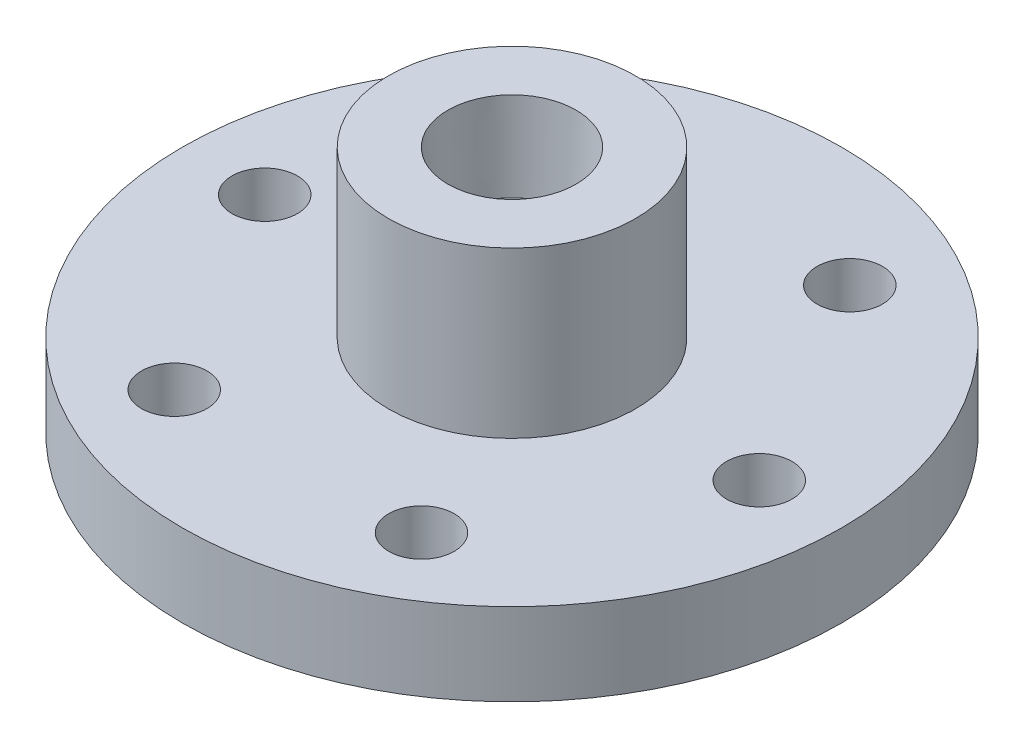
ISO-10303-21;
HEADER;
FILE_DESCRIPTION(('STEP AP214'),'2;1');
FILE_NAME('part.step','',(''),(''),'','','');
FILE_SCHEMA(('AUTOMOTIVE_DESIGN { 1 0 10303 214 1 1 1 1 }'));
ENDSEC;
DATA;
#1=APPLICATION_CONTEXT('core data for automotive mechanical design processes');
#2=APPLICATION_PROTOCOL_DEFINITION('international standard','automotive_design',2000,#1);
#3=PRODUCT_CONTEXT('',#1,'mechanical');
#4=PRODUCT('Part','Part','',(#3));
#5=PRODUCT_RELATED_PRODUCT_CATEGORY('part','',(#4));
#6=PRODUCT_DEFINITION_FORMATION('','',#4);
#7=PRODUCT_DEFINITION_CONTEXT('part definition',#1,'design');
#8=PRODUCT_DEFINITION('design','',#6,#7);
#9=PRODUCT_DEFINITION_SHAPE('','',#8);
#10=(LENGTH_UNIT() NAMED_UNIT(*) SI_UNIT(.MILLI.,.METRE.));
#11=(NAMED_UNIT(*) PLANE_ANGLE_UNIT() SI_UNIT($,.RADIAN.));
#12=(NAMED_UNIT(*) SI_UNIT($,.STERADIAN.) SOLID_ANGLE_UNIT());
#13=UNCERTAINTY_MEASURE_WITH_UNIT(LENGTH_MEASURE(1.E-05),#10,'distance_accuracy_value','');
#14=(GEOMETRIC_REPRESENTATION_CONTEXT(3) GLOBAL_UNCERTAINTY_ASSIGNED_CONTEXT((#13)) GLOBAL_UNIT_ASSIGNED_CONTEXT((#10,
#11,#12)) REPRESENTATION_CONTEXT('',''));
#15=CARTESIAN_POINT('',(0.,0.,0.));
#16=DIRECTION('',(0.,0.,1.));
#17=DIRECTION('',(1.,0.,0.));
#18=AXIS2_PLACEMENT_3D('',#15,#16,#17);
#19=CARTESIAN_POINT('',(-12.827,0.,0.));
#20=DIRECTION('',(0.,-1.,0.));
#21=DIRECTION('',(0.,0.,-1.));
#22=AXIS2_PLACEMENT_3D('',#19,#20,#21);
#23=PLANE('',#22);
#24=CARTESIAN_POINT('',(19.0500000000004,0.,-32.9955678841869));
#25=DIRECTION('',(0.,1.,0.));
#26=DIRECTION('',(0.,0.,1.));
#27=AXIS2_PLACEMENT_3D('',#24,#25,#26);
#28=CIRCLE('',#27,5.04189999999999);
#29=CARTESIAN_POINT('',(19.0500000000004,0.,-27.9536678841869));
#30=VERTEX_POINT('',#29);
#31=EDGE_CURVE('E141',#30,#30,#28,.T.);
#32=ORIENTED_EDGE('',*,*,#31,.T.);
#33=EDGE_LOOP('',(#32));
#34=FACE_BOUND('',#33,.T.);
#35=CARTESIAN_POINT('',(-19.0499999999997,0.,-32.9955678841873));
#36=DIRECTION('',(0.,1.,0.));
#37=DIRECTION('',(0.,0.,1.));
#38=AXIS2_PLACEMENT_3D('',#35,#36,#37);
#39=CIRCLE('',#38,5.04189999999999);
#40=CARTESIAN_POINT('',(-19.0499999999997,0.,-27.9536678841873));
#41=VERTEX_POINT('',#40);
#42=EDGE_CURVE('E133',#41,#41,#39,.T.);
#43=ORIENTED_EDGE('',*,*,#42,.T.);
#44=EDGE_LOOP('',(#43));
#45=FACE_BOUND('',#44,.T.);
#46=CARTESIAN_POINT('',(-19.0500000000002,0.,32.995567884187));
#47=DIRECTION('',(0.,1.,0.));
#48=DIRECTION('',(0.,0.,1.));
#49=AXIS2_PLACEMENT_3D('',#46,#47,#48);
#50=CIRCLE('',#49,5.04189999999999);
#51=CARTESIAN_POINT('',(-19.0500000000002,0.,38.037467884187));
#52=VERTEX_POINT('',#51);
#53=EDGE_CURVE('E117',#52,#52,#50,.T.);
#54=ORIENTED_EDGE('',*,*,#53,.T.);
#55=EDGE_LOOP('',(#54));
#56=FACE_BOUND('',#55,.T.);
#57=CARTESIAN_POINT('',(19.0499999999999,0.,32.9955678841872));
#58=DIRECTION('',(0.,1.,0.));
#59=DIRECTION('',(0.,0.,1.));
#60=AXIS2_PLACEMENT_3D('',#57,#58,#59);
#61=CIRCLE('',#60,5.04189999999999);
#62=CARTESIAN_POINT('',(19.0499999999999,0.,38.0374678841872));
#63=VERTEX_POINT('',#62);
#64=EDGE_CURVE('E109',#63,#63,#61,.T.);
#65=ORIENTED_EDGE('',*,*,#64,.T.);
#66=EDGE_LOOP('',(#65));
#67=FACE_BOUND('',#66,.T.);
#68=CARTESIAN_POINT('',(38.1,0.,0.));
#69=DIRECTION('',(0.,1.,0.));
#70=DIRECTION('',(0.,0.,1.));
#71=AXIS2_PLACEMENT_3D('',#68,#69,#70);
#72=CIRCLE('',#71,5.04189999999999);
#73=CARTESIAN_POINT('',(38.1,0.,5.04189999999999));
#74=VERTEX_POINT('',#73);
#75=EDGE_CURVE('E101',#74,#74,#72,.T.);
#76=ORIENTED_EDGE('',*,*,#75,.T.);
#77=EDGE_LOOP('',(#76));
#78=FACE_BOUND('',#77,.T.);
#79=CARTESIAN_POINT('',(0.,0.,0.));
#80=DIRECTION('',(0.,1.,0.));
#81=DIRECTION('',(0.,0.,1.));
#82=AXIS2_PLACEMENT_3D('',#79,#80,#81);
#83=CIRCLE('',#82,12.827);
#84=CARTESIAN_POINT('',(0.,0.,12.827));
#85=VERTEX_POINT('',#84);
#86=EDGE_CURVE('E61',#85,#85,#83,.T.);
#87=ORIENTED_EDGE('',*,*,#86,.T.);
#88=EDGE_LOOP('',(#87));
#89=FACE_BOUND('',#88,.T.);
#90=CARTESIAN_POINT('',(0.,0.,0.));
#91=DIRECTION('',(0.,1.,0.));
#92=DIRECTION('',(0.,0.,1.));
#93=AXIS2_PLACEMENT_3D('',#90,#91,#92);
#94=CIRCLE('',#93,50.8);
#95=CARTESIAN_POINT('',(0.,0.,50.8));
#96=VERTEX_POINT('',#95);
#97=EDGE_CURVE('E65',#96,#96,#94,.T.);
#98=ORIENTED_EDGE('',*,*,#97,.F.);
#99=EDGE_LOOP('',(#98));
#100=FACE_BOUND('',#99,.T.);
#101=CARTESIAN_POINT('',(-38.1,0.,0.));
#102=DIRECTION('',(0.,1.,0.));
#103=DIRECTION('',(0.,0.,1.));
#104=AXIS2_PLACEMENT_3D('',#101,#102,#103);
#105=CIRCLE('',#104,5.04189999999999);
#106=CARTESIAN_POINT('',(-38.1,0.,5.04189999999999));
#107=VERTEX_POINT('',#106);
#108=EDGE_CURVE('E125',#107,#107,#105,.T.);
#109=ORIENTED_EDGE('',*,*,#108,.T.);
#110=EDGE_LOOP('',(#109));
#111=FACE_BOUND('',#110,.T.);
#112=ADVANCED_FACE('F41',(#34,#45,#56,#67,#78,#89,#100,#111),#23,.T.);
#113=CARTESIAN_POINT('',(0.,0.,0.));
#114=DIRECTION('',(0.,-1.,0.));
#115=DIRECTION('',(0.,0.,-1.));
#116=AXIS2_PLACEMENT_3D('',#113,#114,#115);
#117=PLANE('',#116);
#118=CARTESIAN_POINT('',(0.,0.,0.));
#119=DIRECTION('',(0.,1.,0.));
#120=DIRECTION('',(0.,0.,1.));
#121=AXIS2_PLACEMENT_3D('',#118,#119,#120);
#122=CIRCLE('',#121,4.76249999999999);
#123=CARTESIAN_POINT('',(0.,0.,4.76249999999999));
#124=VERTEX_POINT('',#123);
#125=EDGE_CURVE('E81',#124,#124,#122,.T.);
#126=ORIENTED_EDGE('',*,*,#125,.T.);
#127=EDGE_LOOP('',(#126));
#128=FACE_BOUND('',#127,.T.);
#129=CARTESIAN_POINT('',(0.,0.,0.));
#130=DIRECTION('',(0.,1.,0.));
#131=DIRECTION('',(0.,0.,1.));
#132=AXIS2_PLACEMENT_3D('',#129,#130,#131);
#133=CIRCLE('',#132,9.525);
#134=CARTESIAN_POINT('',(0.,0.,9.525));
#135=VERTEX_POINT('',#134);
#136=EDGE_CURVE('E10',#135,#135,#133,.T.);
#137=ORIENTED_EDGE('',*,*,#136,.F.);
#138=EDGE_LOOP('',(#137));
#139=FACE_BOUND('',#138,.T.);
#140=ADVANCED_FACE('F43',(#128,#139),#117,.T.);
#141=CARTESIAN_POINT('',(0.,38.1,0.));
#142=DIRECTION('',(0.,1.,0.));
#143=DIRECTION('',(0.,0.,1.));
#144=AXIS2_PLACEMENT_3D('',#141,#142,#143);
#145=CYLINDRICAL_SURFACE('',#144,9.525);
#146=ORIENTED_EDGE('',*,*,#136,.T.);
#147=EDGE_LOOP('',(#146));
#148=FACE_BOUND('',#147,.T.);
#149=CARTESIAN_POINT('',(0.,2.54,0.));
#150=DIRECTION('',(0.,1.,0.));
#151=DIRECTION('',(0.,0.,1.));
#152=AXIS2_PLACEMENT_3D('',#149,#150,#151);
#153=CIRCLE('',#152,9.525);
#154=CARTESIAN_POINT('',(0.,2.54,9.525));
#155=VERTEX_POINT('',#154);
#156=EDGE_CURVE('E50',#155,#155,#153,.T.);
#157=ORIENTED_EDGE('',*,*,#156,.F.);
#158=EDGE_LOOP('',(#157));
#159=FACE_BOUND('',#158,.T.);
#160=ADVANCED_FACE('F195',(#148,#159),#145,.T.);
#161=CARTESIAN_POINT('',(-9.525,2.54,0.));
#162=DIRECTION('',(0.,-1.,0.));
#163=DIRECTION('',(0.,0.,-1.));
#164=AXIS2_PLACEMENT_3D('',#161,#162,#163);
#165=PLANE('',#164);
#166=ORIENTED_EDGE('',*,*,#156,.T.);
#167=EDGE_LOOP('',(#166));
#168=FACE_BOUND('',#167,.T.);
#169=CARTESIAN_POINT('',(0.,2.54,0.));
#170=DIRECTION('',(0.,1.,0.));
#171=DIRECTION('',(0.,0.,1.));
#172=AXIS2_PLACEMENT_3D('',#169,#170,#171);
#173=CIRCLE('',#172,12.827);
#174=CARTESIAN_POINT('',(0.,2.54,12.827));
#175=VERTEX_POINT('',#174);
#176=EDGE_CURVE('E55',#175,#175,#173,.T.);
#177=ORIENTED_EDGE('',*,*,#176,.F.);
#178=EDGE_LOOP('',(#177));
#179=FACE_BOUND('',#178,.T.);
#180=ADVANCED_FACE('F203',(#168,#179),#165,.T.);
#181=CARTESIAN_POINT('',(0.,38.1,0.));
#182=DIRECTION('',(0.,1.,0.));
#183=DIRECTION('',(0.,0.,1.));
#184=AXIS2_PLACEMENT_3D('',#181,#182,#183);
#185=CYLINDRICAL_SURFACE('',#184,12.827);
#186=ORIENTED_EDGE('',*,*,#176,.T.);
#187=EDGE_LOOP('',(#186));
#188=FACE_BOUND('',#187,.T.);
#189=ORIENTED_EDGE('',*,*,#86,.F.);
#190=EDGE_LOOP('',(#189));
#191=FACE_BOUND('',#190,.T.);
#192=ADVANCED_FACE('F200',(#188,#191),#185,.F.);
#193=CARTESIAN_POINT('',(0.,38.1,0.));
#194=DIRECTION('',(0.,1.,0.));
#195=DIRECTION('',(0.,0.,1.));
#196=AXIS2_PLACEMENT_3D('',#193,#194,#195);
#197=CYLINDRICAL_SURFACE('',#196,50.8);
#198=ORIENTED_EDGE('',*,*,#97,.T.);
#199=EDGE_LOOP('',(#198));
#200=FACE_BOUND('',#199,.T.);
#201=CARTESIAN_POINT('',(0.,12.7,0.));
#202=DIRECTION('',(0.,1.,0.));
#203=DIRECTION('',(0.,0.,1.));
#204=AXIS2_PLACEMENT_3D('',#201,#202,#203);
#205=CIRCLE('',#204,50.8);
#206=CARTESIAN_POINT('',(0.,12.7,50.8));
#207=VERTEX_POINT('',#206);
#208=EDGE_CURVE('E69',#207,#207,#205,.T.);
#209=ORIENTED_EDGE('',*,*,#208,.F.);
#210=EDGE_LOOP('',(#209));
#211=FACE_BOUND('',#210,.T.);
#212=ADVANCED_FACE('F156',(#200,#211),#197,.T.);
#213=CARTESIAN_POINT('',(-50.8,12.7,0.));
#214=DIRECTION('',(0.,1.,0.));
#215=DIRECTION('',(0.,0.,1.));
#216=AXIS2_PLACEMENT_3D('',#213,#214,#215);
#217=PLANE('',#216);
#218=CARTESIAN_POINT('',(19.0500000000004,12.7,-32.9955678841869));
#219=DIRECTION('',(0.,1.,0.));
#220=DIRECTION('',(0.,0.,1.));
#221=AXIS2_PLACEMENT_3D('',#218,#219,#220);
#222=CIRCLE('',#221,5.0419);
#223=CARTESIAN_POINT('',(19.0500000000004,12.7,-27.9536678841869));
#224=VERTEX_POINT('',#223);
#225=EDGE_CURVE('E145',#224,#224,#222,.T.);
#226=ORIENTED_EDGE('',*,*,#225,.F.);
#227=EDGE_LOOP('',(#226));
#228=FACE_BOUND('',#227,.T.);
#229=CARTESIAN_POINT('',(-19.0499999999997,12.7,-32.9955678841873));
#230=DIRECTION('',(0.,1.,0.));
#231=DIRECTION('',(0.,0.,1.));
#232=AXIS2_PLACEMENT_3D('',#229,#230,#231);
#233=CIRCLE('',#232,5.0419);
#234=CARTESIAN_POINT('',(-19.0499999999997,12.7,-27.9536678841873));
#235=VERTEX_POINT('',#234);
#236=EDGE_CURVE('E137',#235,#235,#233,.T.);
#237=ORIENTED_EDGE('',*,*,#236,.F.);
#238=EDGE_LOOP('',(#237));
#239=FACE_BOUND('',#238,.T.);
#240=CARTESIAN_POINT('',(-38.1,12.7,0.));
#241=DIRECTION('',(0.,1.,0.));
#242=DIRECTION('',(0.,0.,1.));
#243=AXIS2_PLACEMENT_3D('',#240,#241,#242);
#244=CIRCLE('',#243,5.04189999999999);
#245=CARTESIAN_POINT('',(-38.1,12.7,5.04189999999999));
#246=VERTEX_POINT('',#245);
#247=EDGE_CURVE('E129',#246,#246,#244,.T.);
#248=ORIENTED_EDGE('',*,*,#247,.F.);
#249=EDGE_LOOP('',(#248));
#250=FACE_BOUND('',#249,.T.);
#251=CARTESIAN_POINT('',(-19.0500000000002,12.7,32.995567884187));
#252=DIRECTION('',(0.,1.,0.));
#253=DIRECTION('',(0.,0.,1.));
#254=AXIS2_PLACEMENT_3D('',#251,#252,#253);
#255=CIRCLE('',#254,5.0419);
#256=CARTESIAN_POINT('',(-19.0500000000002,12.7,38.037467884187));
#257=VERTEX_POINT('',#256);
#258=EDGE_CURVE('E121',#257,#257,#255,.T.);
#259=ORIENTED_EDGE('',*,*,#258,.F.);
#260=EDGE_LOOP('',(#259));
#261=FACE_BOUND('',#260,.T.);
#262=CARTESIAN_POINT('',(19.0499999999999,12.7,32.9955678841872));
#263=DIRECTION('',(0.,1.,0.));
#264=DIRECTION('',(0.,0.,1.));
#265=AXIS2_PLACEMENT_3D('',#262,#263,#264);
#266=CIRCLE('',#265,5.0419);
#267=CARTESIAN_POINT('',(19.0499999999999,12.7,38.0374678841872));
#268=VERTEX_POINT('',#267);
#269=EDGE_CURVE('E113',#268,#268,#266,.T.);
#270=ORIENTED_EDGE('',*,*,#269,.F.);
#271=EDGE_LOOP('',(#270));
#272=FACE_BOUND('',#271,.T.);
#273=CARTESIAN_POINT('',(38.1,12.7,0.));
#274=DIRECTION('',(0.,1.,0.));
#275=DIRECTION('',(0.,0.,1.));
#276=AXIS2_PLACEMENT_3D('',#273,#274,#275);
#277=CIRCLE('',#276,5.04189999999999);
#278=CARTESIAN_POINT('',(38.1,12.7,5.04189999999999));
#279=VERTEX_POINT('',#278);
#280=EDGE_CURVE('E105',#279,#279,#277,.T.);
#281=ORIENTED_EDGE('',*,*,#280,.F.);
#282=EDGE_LOOP('',(#281));
#283=FACE_BOUND('',#282,.T.);
#284=ORIENTED_EDGE('',*,*,#208,.T.);
#285=EDGE_LOOP('',(#284));
#286=FACE_BOUND('',#285,.T.);
#287=CARTESIAN_POINT('',(0.,12.7,0.));
#288=DIRECTION('',(0.,1.,0.));
#289=DIRECTION('',(0.,0.,1.));
#290=AXIS2_PLACEMENT_3D('',#287,#288,#289);
#291=CIRCLE('',#290,19.05);
#292=CARTESIAN_POINT('',(0.,12.7,19.05));
#293=VERTEX_POINT('',#292);
#294=EDGE_CURVE('E73',#293,#293,#291,.T.);
#295=ORIENTED_EDGE('',*,*,#294,.F.);
#296=EDGE_LOOP('',(#295));
#297=FACE_BOUND('',#296,.T.);
#298=ADVANCED_FACE('F152',(#228,#239,#250,#261,#272,#283,#286,#297),#217,.T.);
#299=CARTESIAN_POINT('',(0.,38.1,0.));
#300=DIRECTION('',(0.,1.,0.));
#301=DIRECTION('',(0.,0.,1.));
#302=AXIS2_PLACEMENT_3D('',#299,#300,#301);
#303=CYLINDRICAL_SURFACE('',#302,19.05);
#304=ORIENTED_EDGE('',*,*,#294,.T.);
#305=EDGE_LOOP('',(#304));
#306=FACE_BOUND('',#305,.T.);
#307=CARTESIAN_POINT('',(0.,38.1,0.));
#308=DIRECTION('',(0.,1.,0.));
#309=DIRECTION('',(0.,0.,1.));
#310=AXIS2_PLACEMENT_3D('',#307,#308,#309);
#311=CIRCLE('',#310,19.05);
#312=CARTESIAN_POINT('',(0.,38.1,19.05));
#313=VERTEX_POINT('',#312);
#314=EDGE_CURVE('E77',#313,#313,#311,.T.);
#315=ORIENTED_EDGE('',*,*,#314,.F.);
#316=EDGE_LOOP('',(#315));
#317=FACE_BOUND('',#316,.T.);
#318=ADVANCED_FACE('F155',(#306,#317),#303,.T.);
#319=CARTESIAN_POINT('',(-19.05,38.1,0.));
#320=DIRECTION('',(0.,1.,0.));
#321=DIRECTION('',(0.,0.,1.));
#322=AXIS2_PLACEMENT_3D('',#319,#320,#321);
#323=PLANE('',#322);
#324=CARTESIAN_POINT('',(0.,38.1,0.));
#325=DIRECTION('',(0.,1.,0.));
#326=DIRECTION('',(0.,0.,1.));
#327=AXIS2_PLACEMENT_3D('',#324,#325,#326);
#328=CIRCLE('',#327,9.8827971);
#329=CARTESIAN_POINT('',(0.,38.1,9.8827971));
#330=VERTEX_POINT('',#329);
#331=EDGE_CURVE('E97',#330,#330,#328,.T.);
#332=ORIENTED_EDGE('',*,*,#331,.F.);
#333=EDGE_LOOP('',(#332));
#334=FACE_BOUND('',#333,.T.);
#335=ORIENTED_EDGE('',*,*,#314,.T.);
#336=EDGE_LOOP('',(#335));
#337=FACE_BOUND('',#336,.T.);
#338=ADVANCED_FACE('F174',(#334,#337),#323,.T.);
#339=CARTESIAN_POINT('',(0.,38.1,0.));
#340=DIRECTION('',(0.,1.,0.));
#341=DIRECTION('',(0.,0.,1.));
#342=AXIS2_PLACEMENT_3D('',#339,#340,#341);
#343=CYLINDRICAL_SURFACE('',#342,4.76249999999999);
#344=CARTESIAN_POINT('',(0.,12.9910550053788,0.));
#345=DIRECTION('',(0.,1.,0.));
#346=DIRECTION('',(0.,0.,1.));
#347=AXIS2_PLACEMENT_3D('',#344,#345,#346);
#348=CIRCLE('',#347,4.76249999999999);
#349=CARTESIAN_POINT('',(0.,12.9910550053788,4.76249999999999));
#350=VERTEX_POINT('',#349);
#351=EDGE_CURVE('E45',#350,#350,#348,.T.);
#352=ORIENTED_EDGE('',*,*,#351,.T.);
#353=EDGE_LOOP('',(#352));
#354=FACE_BOUND('',#353,.T.);
#355=ORIENTED_EDGE('',*,*,#125,.F.);
#356=EDGE_LOOP('',(#355));
#357=FACE_BOUND('',#356,.T.);
#358=ADVANCED_FACE('F179',(#354,#357),#343,.F.);
#359=CARTESIAN_POINT('',(0.,15.494,0.));
#360=DIRECTION('',(0.,1.,0.));
#361=DIRECTION('',(0.,0.,1.));
#362=AXIS2_PLACEMENT_3D('',#359,#360,#361);
#363=CONICAL_SURFACE('',#362,8.92810000000001,1.02974425867665);
#364=CARTESIAN_POINT('',(0.,15.494,0.));
#365=DIRECTION('',(0.,1.,0.));
#366=DIRECTION('',(0.,0.,1.));
#367=AXIS2_PLACEMENT_3D('',#364,#365,#366);
#368=CIRCLE('',#367,8.92810000000001);
#369=CARTESIAN_POINT('',(0.,15.494,8.92810000000001));
#370=VERTEX_POINT('',#369);
#371=EDGE_CURVE('E85',#370,#370,#368,.T.);
#372=ORIENTED_EDGE('',*,*,#371,.T.);
#373=EDGE_LOOP('',(#372));
#374=FACE_BOUND('',#373,.T.);
#375=ORIENTED_EDGE('',*,*,#351,.F.);
#376=EDGE_LOOP('',(#375));
#377=FACE_BOUND('',#376,.T.);
#378=ADVANCED_FACE('F185',(#374,#377),#363,.F.);
#379=CARTESIAN_POINT('',(0.,38.1,0.));
#380=DIRECTION('',(0.,1.,0.));
#381=DIRECTION('',(0.,0.,1.));
#382=AXIS2_PLACEMENT_3D('',#379,#380,#381);
#383=CYLINDRICAL_SURFACE('',#382,8.92810000000001);
#384=ORIENTED_EDGE('',*,*,#371,.F.);
#385=EDGE_LOOP('',(#384));
#386=FACE_BOUND('',#385,.T.);
#387=CARTESIAN_POINT('',(0.,24.638,0.));
#388=DIRECTION('',(0.,1.,0.));
#389=DIRECTION('',(0.,0.,1.));
#390=AXIS2_PLACEMENT_3D('',#387,#388,#389);
#391=CIRCLE('',#390,8.92810000000001);
#392=CARTESIAN_POINT('',(0.,24.638,8.92810000000001));
#393=VERTEX_POINT('',#392);
#394=EDGE_CURVE('E89',#393,#393,#391,.T.);
#395=ORIENTED_EDGE('',*,*,#394,.T.);
#396=EDGE_LOOP('',(#395));
#397=FACE_BOUND('',#396,.T.);
#398=ADVANCED_FACE('F253',(#386,#397),#383,.F.);
#399=CARTESIAN_POINT('',(8.92810000000001,24.638,0.));
#400=DIRECTION('',(0.,-1.,0.));
#401=DIRECTION('',(0.,0.,-1.));
#402=AXIS2_PLACEMENT_3D('',#399,#400,#401);
#403=PLANE('',#402);
#404=ORIENTED_EDGE('',*,*,#394,.F.);
#405=EDGE_LOOP('',(#404));
#406=FACE_BOUND('',#405,.T.);
#407=CARTESIAN_POINT('',(0.,24.638,0.));
#408=DIRECTION('',(0.,1.,0.));
#409=DIRECTION('',(0.,0.,1.));
#410=AXIS2_PLACEMENT_3D('',#407,#408,#409);
#411=CIRCLE('',#410,9.47972679208631);
#412=CARTESIAN_POINT('',(0.,24.638,9.47972679208631));
#413=VERTEX_POINT('',#412);
#414=EDGE_CURVE('E93',#413,#413,#411,.T.);
#415=ORIENTED_EDGE('',*,*,#414,.T.);
#416=EDGE_LOOP('',(#415));
#417=FACE_BOUND('',#416,.T.);
#418=ADVANCED_FACE('F249',(#406,#417),#403,.F.);
#419=CARTESIAN_POINT('',(0.,38.1,0.));
#420=DIRECTION('',(0.,1.,0.));
#421=DIRECTION('',(0.,0.,1.));
#422=AXIS2_PLACEMENT_3D('',#419,#420,#421);
#423=CONICAL_SURFACE('',#422,9.8827971,0.0299323966717028);
#424=ORIENTED_EDGE('',*,*,#414,.F.);
#425=EDGE_LOOP('',(#424));
#426=FACE_BOUND('',#425,.T.);
#427=ORIENTED_EDGE('',*,*,#331,.T.);
#428=EDGE_LOOP('',(#427));
#429=FACE_BOUND('',#428,.T.);
#430=ADVANCED_FACE('F245',(#426,#429),#423,.F.);
#431=CARTESIAN_POINT('',(38.1,12.7,0.));
#432=DIRECTION('',(0.,1.,0.));
#433=DIRECTION('',(0.,0.,1.));
#434=AXIS2_PLACEMENT_3D('',#431,#432,#433);
#435=CYLINDRICAL_SURFACE('',#434,5.04189999999999);
#436=ORIENTED_EDGE('',*,*,#75,.F.);
#437=EDGE_LOOP('',(#436));
#438=FACE_BOUND('',#437,.T.);
#439=ORIENTED_EDGE('',*,*,#280,.T.);
#440=EDGE_LOOP('',(#439));
#441=FACE_BOUND('',#440,.T.);
#442=ADVANCED_FACE('F241',(#438,#441),#435,.F.);
#443=CARTESIAN_POINT('',(19.0499999999999,12.7,32.9955678841872));
#444=DIRECTION('',(0.,1.,0.));
#445=DIRECTION('',(0.,0.,1.));
#446=AXIS2_PLACEMENT_3D('',#443,#444,#445);
#447=CYLINDRICAL_SURFACE('',#446,5.0419);
#448=ORIENTED_EDGE('',*,*,#64,.F.);
#449=EDGE_LOOP('',(#448));
#450=FACE_BOUND('',#449,.T.);
#451=ORIENTED_EDGE('',*,*,#269,.T.);
#452=EDGE_LOOP('',(#451));
#453=FACE_BOUND('',#452,.T.);
#454=ADVANCED_FACE('F234',(#450,#453),#447,.F.);
#455=CARTESIAN_POINT('',(-19.0500000000002,12.7,32.995567884187));
#456=DIRECTION('',(0.,1.,0.));
#457=DIRECTION('',(0.,0.,1.));
#458=AXIS2_PLACEMENT_3D('',#455,#456,#457);
#459=CYLINDRICAL_SURFACE('',#458,5.0419);
#460=ORIENTED_EDGE('',*,*,#53,.F.);
#461=EDGE_LOOP('',(#460));
#462=FACE_BOUND('',#461,.T.);
#463=ORIENTED_EDGE('',*,*,#258,.T.);
#464=EDGE_LOOP('',(#463));
#465=FACE_BOUND('',#464,.T.);
#466=ADVANCED_FACE('F226',(#462,#465),#459,.F.);
#467=CARTESIAN_POINT('',(-38.1,12.7,0.));
#468=DIRECTION('',(0.,1.,0.));
#469=DIRECTION('',(0.,0.,1.));
#470=AXIS2_PLACEMENT_3D('',#467,#468,#469);
#471=CYLINDRICAL_SURFACE('',#470,5.04189999999999);
#472=ORIENTED_EDGE('',*,*,#108,.F.);
#473=EDGE_LOOP('',(#472));
#474=FACE_BOUND('',#473,.T.);
#475=ORIENTED_EDGE('',*,*,#247,.T.);
#476=EDGE_LOOP('',(#475));
#477=FACE_BOUND('',#476,.T.);
#478=ADVANCED_FACE('F222',(#474,#477),#471,.F.);
#479=CARTESIAN_POINT('',(-19.0499999999997,12.7,-32.9955678841873));
#480=DIRECTION('',(0.,1.,0.));
#481=DIRECTION('',(0.,0.,1.));
#482=AXIS2_PLACEMENT_3D('',#479,#480,#481);
#483=CYLINDRICAL_SURFACE('',#482,5.0419);
#484=ORIENTED_EDGE('',*,*,#42,.F.);
#485=EDGE_LOOP('',(#484));
#486=FACE_BOUND('',#485,.T.);
#487=ORIENTED_EDGE('',*,*,#236,.T.);
#488=EDGE_LOOP('',(#487));
#489=FACE_BOUND('',#488,.T.);
#490=ADVANCED_FACE('F225',(#486,#489),#483,.F.);
#491=CARTESIAN_POINT('',(19.0500000000004,12.7,-32.9955678841869));
#492=DIRECTION('',(0.,1.,0.));
#493=DIRECTION('',(0.,0.,1.));
#494=AXIS2_PLACEMENT_3D('',#491,#492,#493);
#495=CYLINDRICAL_SURFACE('',#494,5.0419);
#496=ORIENTED_EDGE('',*,*,#31,.F.);
#497=EDGE_LOOP('',(#496));
#498=FACE_BOUND('',#497,.T.);
#499=ORIENTED_EDGE('',*,*,#225,.T.);
#500=EDGE_LOOP('',(#499));
#501=FACE_BOUND('',#500,.T.);
#502=ADVANCED_FACE('F150',(#498,#501),#495,.F.);
#503=CLOSED_SHELL('',(#112,#140,#160,#180,#192,#212,#298,#318,#338,#358,#378,#398,#418,#430,
#442,#454,#466,#478,#490,#502));
#504=MANIFOLD_SOLID_BREP('B2',#503);
#505=ADVANCED_BREP_SHAPE_REPRESENTATION('',(#18,#504),#14);
#506=SHAPE_DEFINITION_REPRESENTATION(#9,#505);
ENDSEC;
END-ISO-10303-21;
